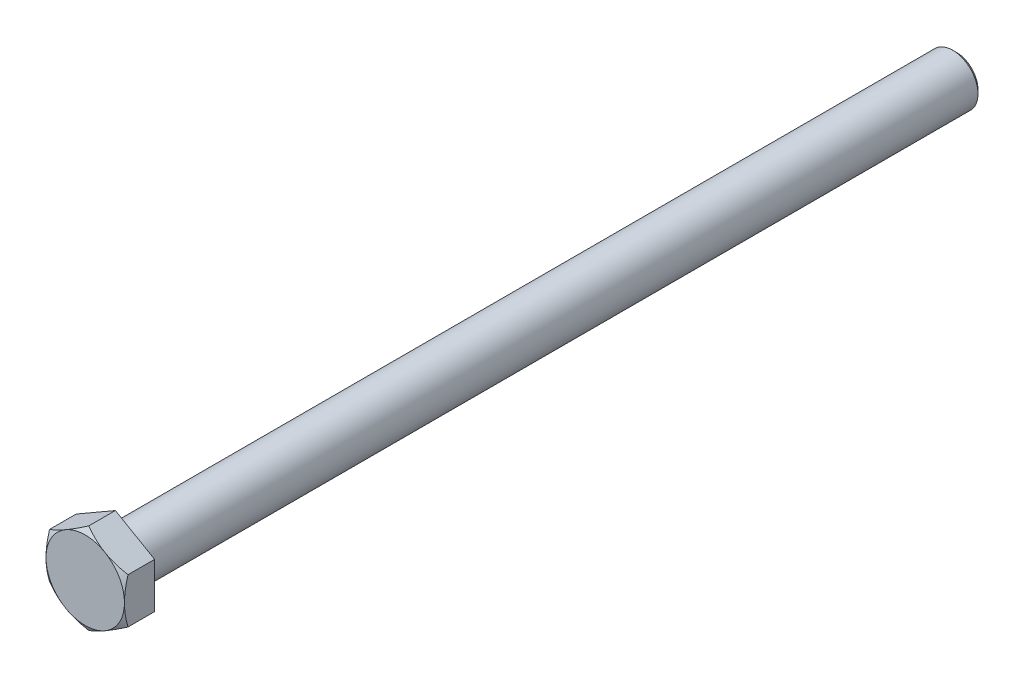
ISO-10303-21;
HEADER;
FILE_DESCRIPTION(('STEP AP214'),'2;1');
FILE_NAME('part.step','',(''),(''),'','','');
FILE_SCHEMA(('AUTOMOTIVE_DESIGN { 1 0 10303 214 1 1 1 1 }'));
ENDSEC;
DATA;
#1=APPLICATION_CONTEXT('core data for automotive mechanical design processes');
#2=APPLICATION_PROTOCOL_DEFINITION('international standard','automotive_design',2000,#1);
#3=PRODUCT_CONTEXT('',#1,'mechanical');
#4=PRODUCT('Part','Part','',(#3));
#5=PRODUCT_RELATED_PRODUCT_CATEGORY('part','',(#4));
#6=PRODUCT_DEFINITION_FORMATION('','',#4);
#7=PRODUCT_DEFINITION_CONTEXT('part definition',#1,'design');
#8=PRODUCT_DEFINITION('design','',#6,#7);
#9=PRODUCT_DEFINITION_SHAPE('','',#8);
#10=(LENGTH_UNIT() NAMED_UNIT(*) SI_UNIT(.MILLI.,.METRE.));
#11=(NAMED_UNIT(*) PLANE_ANGLE_UNIT() SI_UNIT($,.RADIAN.));
#12=(NAMED_UNIT(*) SI_UNIT($,.STERADIAN.) SOLID_ANGLE_UNIT());
#13=UNCERTAINTY_MEASURE_WITH_UNIT(LENGTH_MEASURE(1.E-05),#10,'distance_accuracy_value','');
#14=(GEOMETRIC_REPRESENTATION_CONTEXT(3) GLOBAL_UNCERTAINTY_ASSIGNED_CONTEXT((#13)) GLOBAL_UNIT_ASSIGNED_CONTEXT((#10,
#11,#12)) REPRESENTATION_CONTEXT('',''));
#15=CARTESIAN_POINT('',(0.,0.,0.));
#16=DIRECTION('',(0.,0.,1.));
#17=DIRECTION('',(1.,0.,0.));
#18=AXIS2_PLACEMENT_3D('',#15,#16,#17);
#19=CARTESIAN_POINT('',(0.,0.,0.));
#20=DIRECTION('',(0.,0.,1.));
#21=DIRECTION('',(1.,0.,0.));
#22=AXIS2_PLACEMENT_3D('',#19,#20,#21);
#23=PLANE('',#22);
#24=CARTESIAN_POINT('',(0.,0.,0.));
#25=DIRECTION('',(0.,0.,1.));
#26=DIRECTION('',(1.,0.,0.));
#27=AXIS2_PLACEMENT_3D('',#24,#25,#26);
#28=CIRCLE('',#27,6.6);
#29=CARTESIAN_POINT('',(6.6,0.,0.));
#30=VERTEX_POINT('',#29);
#31=EDGE_CURVE('E146',#30,#30,#28,.T.);
#32=ORIENTED_EDGE('',*,*,#31,.T.);
#33=EDGE_LOOP('',(#32));
#34=FACE_BOUND('',#33,.T.);
#35=CARTESIAN_POINT('',(0.,0.,0.));
#36=DIRECTION('',(0.,0.,1.));
#37=DIRECTION('',(1.,0.,0.));
#38=AXIS2_PLACEMENT_3D('',#35,#36,#37);
#39=CIRCLE('',#38,8.7);
#40=CARTESIAN_POINT('',(8.7,0.,0.));
#41=VERTEX_POINT('',#40);
#42=EDGE_CURVE('E292',#41,#41,#39,.T.);
#43=ORIENTED_EDGE('',*,*,#42,.F.);
#44=EDGE_LOOP('',(#43));
#45=FACE_BOUND('',#44,.T.);
#46=ADVANCED_FACE('F37',(#34,#45),#23,.F.);
#47=CARTESIAN_POINT('',(0.,0.,-0.6));
#48=DIRECTION('',(0.,0.,1.));
#49=DIRECTION('',(1.,0.,0.));
#50=AXIS2_PLACEMENT_3D('',#47,#48,#49);
#51=TOROIDAL_SURFACE('',#50,6.6,0.6);
#52=ORIENTED_EDGE('',*,*,#31,.F.);
#53=EDGE_LOOP('',(#52));
#54=FACE_BOUND('',#53,.T.);
#55=CARTESIAN_POINT('',(0.,0.,-0.6));
#56=DIRECTION('',(0.,0.,1.));
#57=DIRECTION('',(1.,0.,0.));
#58=AXIS2_PLACEMENT_3D('',#55,#56,#57);
#59=CIRCLE('',#58,6.00000000000001);
#60=CARTESIAN_POINT('',(6.00000000000001,0.,-0.6));
#61=VERTEX_POINT('',#60);
#62=EDGE_CURVE('E149',#61,#61,#59,.T.);
#63=ORIENTED_EDGE('',*,*,#62,.T.);
#64=EDGE_LOOP('',(#63));
#65=FACE_BOUND('',#64,.T.);
#66=ADVANCED_FACE('F233',(#54,#65),#51,.F.);
#67=CARTESIAN_POINT('',(0.,0.,0.));
#68=DIRECTION('',(0.,0.,1.));
#69=DIRECTION('',(1.,0.,0.));
#70=AXIS2_PLACEMENT_3D('',#67,#68,#69);
#71=CYLINDRICAL_SURFACE('',#70,6.00000000000002);
#72=ORIENTED_EDGE('',*,*,#62,.F.);
#73=EDGE_LOOP('',(#72));
#74=FACE_BOUND('',#73,.T.);
#75=CARTESIAN_POINT('',(0.,0.,-199.1));
#76=DIRECTION('',(0.,0.,1.));
#77=DIRECTION('',(1.,0.,0.));
#78=AXIS2_PLACEMENT_3D('',#75,#76,#77);
#79=CIRCLE('',#78,6.00000000000003);
#80=CARTESIAN_POINT('',(6.00000000000003,0.,-199.1));
#81=VERTEX_POINT('',#80);
#82=EDGE_CURVE('E152',#81,#81,#79,.T.);
#83=ORIENTED_EDGE('',*,*,#82,.T.);
#84=EDGE_LOOP('',(#83));
#85=FACE_BOUND('',#84,.T.);
#86=ADVANCED_FACE('F239',(#74,#85),#71,.T.);
#87=CARTESIAN_POINT('',(0.,0.,-200.));
#88=DIRECTION('',(0.,0.,1.));
#89=DIRECTION('',(1.,0.,0.));
#90=AXIS2_PLACEMENT_3D('',#87,#88,#89);
#91=CONICAL_SURFACE('',#90,5.1,0.785398163397458);
#92=ORIENTED_EDGE('',*,*,#82,.F.);
#93=EDGE_LOOP('',(#92));
#94=FACE_BOUND('',#93,.T.);
#95=CARTESIAN_POINT('',(0.,0.,-200.));
#96=DIRECTION('',(0.,0.,1.));
#97=DIRECTION('',(1.,0.,0.));
#98=AXIS2_PLACEMENT_3D('',#95,#96,#97);
#99=CIRCLE('',#98,5.1);
#100=CARTESIAN_POINT('',(5.1,0.,-200.));
#101=VERTEX_POINT('',#100);
#102=EDGE_CURVE('E125',#101,#101,#99,.T.);
#103=ORIENTED_EDGE('',*,*,#102,.T.);
#104=EDGE_LOOP('',(#103));
#105=FACE_BOUND('',#104,.T.);
#106=ADVANCED_FACE('F306',(#94,#105),#91,.T.);
#107=CARTESIAN_POINT('',(0.,5.1,-200.));
#108=DIRECTION('',(0.,0.,1.));
#109=DIRECTION('',(1.,0.,0.));
#110=AXIS2_PLACEMENT_3D('',#107,#108,#109);
#111=PLANE('',#110);
#112=ORIENTED_EDGE('',*,*,#102,.F.);
#113=EDGE_LOOP('',(#112));
#114=FACE_BOUND('',#113,.T.);
#115=ADVANCED_FACE('F302',(#114),#111,.F.);
#116=CARTESIAN_POINT('',(0.,10.7791295257703,0.149999999999997));
#117=DIRECTION('',(0.,0.,-1.));
#118=DIRECTION('',(-1.,0.,0.));
#119=AXIS2_PLACEMENT_3D('',#116,#117,#118);
#120=PLANE('',#119);
#121=CARTESIAN_POINT('',(0.,0.,0.149999999999996));
#122=DIRECTION('',(0.,0.,1.));
#123=DIRECTION('',(1.,0.,0.));
#124=AXIS2_PLACEMENT_3D('',#121,#122,#123);
#125=CIRCLE('',#124,8.78660254037844);
#126=CARTESIAN_POINT('',(8.78660254037844,0.,0.149999999999996));
#127=VERTEX_POINT('',#126);
#128=EDGE_CURVE('E289',#127,#127,#125,.T.);
#129=ORIENTED_EDGE('',*,*,#128,.T.);
#130=EDGE_LOOP('',(#129));
#131=FACE_BOUND('',#130,.T.);
#132=DIRECTION('',(0.866025403784439,-0.5,0.));
#133=VECTOR('',#132,1.);
#134=CARTESIAN_POINT('',(9.33499999999998,5.38956476288517,0.149999999999996));
#135=LINE('',#134,#133);
#136=CARTESIAN_POINT('',(0.,10.7791295257703,0.149999999999997));
#137=VERTEX_POINT('',#136);
#138=CARTESIAN_POINT('',(9.33499999999998,5.38956476288517,0.149999999999996));
#139=VERTEX_POINT('',#138);
#140=EDGE_CURVE('E60',#137,#139,#135,.T.);
#141=ORIENTED_EDGE('',*,*,#140,.T.);
#142=DIRECTION('',(0.,-1.,0.));
#143=VECTOR('',#142,1.);
#144=CARTESIAN_POINT('',(9.33499999999999,-5.38956476288515,0.149999999999996));
#145=LINE('',#144,#143);
#146=CARTESIAN_POINT('',(9.33499999999999,-5.38956476288519,0.149999999999997));
#147=VERTEX_POINT('',#146);
#148=EDGE_CURVE('E11',#139,#147,#145,.T.);
#149=ORIENTED_EDGE('',*,*,#148,.T.);
#150=DIRECTION('',(-0.866025403784439,-0.5,0.));
#151=VECTOR('',#150,1.);
#152=CARTESIAN_POINT('',(0.,-10.7791295257703,0.149999999999996));
#153=LINE('',#152,#151);
#154=CARTESIAN_POINT('',(0.,-10.7791295257703,0.149999999999997));
#155=VERTEX_POINT('',#154);
#156=EDGE_CURVE('E160',#147,#155,#153,.T.);
#157=ORIENTED_EDGE('',*,*,#156,.T.);
#158=DIRECTION('',(-0.866025403784439,0.5,0.));
#159=VECTOR('',#158,1.);
#160=CARTESIAN_POINT('',(-9.335,-5.38956476288515,0.149999999999996));
#161=LINE('',#160,#159);
#162=CARTESIAN_POINT('',(-9.33500000000002,-5.38956476288514,0.149999999999997));
#163=VERTEX_POINT('',#162);
#164=EDGE_CURVE('E158',#155,#163,#161,.T.);
#165=ORIENTED_EDGE('',*,*,#164,.T.);
#166=DIRECTION('',(0.,1.,0.));
#167=VECTOR('',#166,1.);
#168=CARTESIAN_POINT('',(-9.335,5.38956476288516,0.149999999999996));
#169=LINE('',#168,#167);
#170=CARTESIAN_POINT('',(-9.335,5.38956476288517,0.149999999999997));
#171=VERTEX_POINT('',#170);
#172=EDGE_CURVE('E111',#163,#171,#169,.T.);
#173=ORIENTED_EDGE('',*,*,#172,.T.);
#174=DIRECTION('',(0.866025403784439,0.5,0.));
#175=VECTOR('',#174,1.);
#176=CARTESIAN_POINT('',(0.,10.7791295257703,0.149999999999996));
#177=LINE('',#176,#175);
#178=EDGE_CURVE('E108',#171,#137,#177,.T.);
#179=ORIENTED_EDGE('',*,*,#178,.T.);
#180=EDGE_LOOP('',(#141,#149,#157,#165,#173,#179));
#181=FACE_BOUND('',#180,.T.);
#182=ADVANCED_FACE('F109',(#131,#181),#120,.T.);
#183=CARTESIAN_POINT('',(0.,0.,0.149999999999996));
#184=DIRECTION('',(0.,0.,1.));
#185=DIRECTION('',(1.,0.,0.));
#186=AXIS2_PLACEMENT_3D('',#183,#184,#185);
#187=CONICAL_SURFACE('',#186,8.78660254037844,0.5235987755983);
#188=ORIENTED_EDGE('',*,*,#42,.T.);
#189=EDGE_LOOP('',(#188));
#190=FACE_BOUND('',#189,.T.);
#191=ORIENTED_EDGE('',*,*,#128,.F.);
#192=EDGE_LOOP('',(#191));
#193=FACE_BOUND('',#192,.T.);
#194=ADVANCED_FACE('F184',(#190,#193),#187,.T.);
#195=CARTESIAN_POINT('',(9.33499999999999,-5.38956476288515,7.32));
#196=DIRECTION('',(-1.,0.,0.));
#197=DIRECTION('',(0.,-1.,0.));
#198=AXIS2_PLACEMENT_3D('',#195,#196,#197);
#199=PLANE('',#198);
#200=CARTESIAN_POINT('',(9.335,-14.2939200065664,2.85295320592981));
#201=CARTESIAN_POINT('',(9.335,-14.088997974891,2.9520094781063));
#202=CARTESIAN_POINT('',(9.335,-13.8838282501419,3.05055309058061));
#203=CARTESIAN_POINT('',(9.335,-13.4729410981215,3.24649731903416));
#204=CARTESIAN_POINT('',(9.335,-13.2672236648764,3.34389792248338));
#205=CARTESIAN_POINT('',(9.335,-12.6491110540912,3.63423693699647));
#206=CARTESIAN_POINT('',(9.335,-12.235822190424,3.82528025363824));
#207=CARTESIAN_POINT('',(9.335,-11.4040234451093,4.20217310927294));
#208=CARTESIAN_POINT('',(9.335,-10.9854972201123,4.38798667006708));
#209=CARTESIAN_POINT('',(9.335,-10.1450055951409,4.75163580727913));
#210=CARTESIAN_POINT('',(9.33499999999999,-9.72304037579279,4.92947179955253));
#211=CARTESIAN_POINT('',(9.33499999999999,-8.86976005799766,5.27715066645378));
#212=CARTESIAN_POINT('',(9.33499999999999,-8.43839377157359,5.44686860657388));
#213=CARTESIAN_POINT('',(9.33499999999999,-7.57057438679006,5.77301256488255));
#214=CARTESIAN_POINT('',(9.33499999999999,-7.1341207286125,5.92943710424978));
#215=CARTESIAN_POINT('',(9.33499999999999,-6.25632320665005,6.22479025996925));
#216=CARTESIAN_POINT('',(9.33499999999999,-5.81499199640146,6.36375607260078));
#217=CARTESIAN_POINT('',(9.33499999999999,-4.92607133486536,6.61968098547224));
#218=CARTESIAN_POINT('',(9.33499999999999,-4.47848391093663,6.73664704501724));
#219=CARTESIAN_POINT('',(9.33499999999999,-3.57667031207659,6.94288552890628));
#220=CARTESIAN_POINT('',(9.33499999999999,-3.12244240313707,7.03215057946492));
#221=CARTESIAN_POINT('',(9.33499999999999,-2.43710350689067,7.14080282116499));
#222=CARTESIAN_POINT('',(9.33499999999999,-2.20796291905845,7.17281503726186));
#223=CARTESIAN_POINT('',(9.33499999999999,-1.7486074317416,7.22779448910464));
#224=CARTESIAN_POINT('',(9.33499999999999,-1.51839264089889,7.25076262030697));
#225=CARTESIAN_POINT('',(9.33499999999999,-1.05866032543275,7.2870357991655));
#226=CARTESIAN_POINT('',(9.33499999999999,-0.829147554394165,7.30040085149546));
#227=CARTESIAN_POINT('',(9.33499999999999,-0.369761997153315,7.3173972114006));
#228=CARTESIAN_POINT('',(9.33499999999999,-0.139889215665096,7.3210286453807));
#229=CARTESIAN_POINT('',(9.33499999999999,0.319737952102246,7.31847123986234));
#230=CARTESIAN_POINT('',(9.33499999999999,0.549492353502908,7.31228515639623));
#231=CARTESIAN_POINT('',(9.33499999999999,1.00854016574668,7.29024654738462));
#232=CARTESIAN_POINT('',(9.33499999999999,1.23783355299476,7.27439353910945));
#233=CARTESIAN_POINT('',(9.33499999999999,1.79357012506472,7.22458635458605));
#234=CARTESIAN_POINT('',(9.33499999999999,2.11958632864347,7.18578870330552));
#235=CARTESIAN_POINT('',(9.33499999999999,2.76912050377264,7.09080439036287));
#236=CARTESIAN_POINT('',(9.33499999999999,3.09263776870017,7.03461298239445));
#237=CARTESIAN_POINT('',(9.33499999999999,3.73690716837231,6.90683408562496));
#238=CARTESIAN_POINT('',(9.33499999999998,4.05765638835195,6.83523203973257));
#239=CARTESIAN_POINT('',(9.33499999999998,4.69585477456489,6.67881653034048));
#240=CARTESIAN_POINT('',(9.33499999999998,5.01330424867696,6.59400431141982));
#241=CARTESIAN_POINT('',(9.33499999999998,5.65272185353181,6.41098051072343));
#242=CARTESIAN_POINT('',(9.33499999999998,5.97461000805293,6.31249144069197));
#243=CARTESIAN_POINT('',(9.33499999999998,6.61498395116541,6.10578201115479));
#244=CARTESIAN_POINT('',(9.33499999999998,6.93347191931351,5.99756836370945));
#245=CARTESIAN_POINT('',(9.33499999999998,7.56576751363664,5.77364503844619));
#246=CARTESIAN_POINT('',(9.33499999999998,7.87959139360188,5.65798098174213));
#247=CARTESIAN_POINT('',(9.33499999999998,8.50480431543778,5.41986404687111));
#248=CARTESIAN_POINT('',(9.33499999999998,8.81619231437714,5.29740842489412));
#249=CARTESIAN_POINT('',(9.33499999999998,9.12644907510167,5.17222885598316));
#250=B_SPLINE_CURVE_WITH_KNOTS('',3,(#200,#201,#202,#203,#204,#205,#206,#207,#208,#209,#210,
#211,#212,#213,#214,#215,#216,#217,#218,#219,#220,#221,#222,#223,#224,#225,#226,#227,#228,#229,
#230,#231,#232,#233,#234,#235,#236,#237,#238,#239,#240,#241,#242,#243,#244,#245,#246,#247,#248,
#249),.UNSPECIFIED.,.F.,.F.,(4,2,2,2,2,2,2,2,2,2,2,2,2,2,2,2,2,2,2,2,2,2,2,2,4),(0.,
0.682821242993056,1.36564996430024,2.73152951663905,4.10522544602874,5.4788496838501,
6.86933776425677,8.25998032725736,9.64760794835793,11.0347958724513,12.4223527386737,
13.1163000222239,13.8101785806472,14.4996828280991,15.1891781213109,15.8784798895067,
16.5678160816468,17.5522174713367,18.5368877158521,19.5224922074151,20.5080038976543,
21.5176726092966,22.5266497067172,23.5299476031869,24.5336538298085),.UNSPECIFIED.);
#251=CARTESIAN_POINT('',(9.33499999999999,-5.38956476288519,6.48623142955183));
#252=VERTEX_POINT('',#251);
#253=CARTESIAN_POINT('',(9.33499999999998,0.,7.32));
#254=VERTEX_POINT('',#253);
#255=EDGE_CURVE('E287',#252,#254,#250,.T.);
#256=ORIENTED_EDGE('',*,*,#255,.F.);
#257=DIRECTION('',(0.,0.,-1.));
#258=VECTOR('',#257,1.);
#259=CARTESIAN_POINT('',(9.33499999999999,-5.38956476288515,7.32));
#260=LINE('',#259,#258);
#261=EDGE_CURVE('E142',#252,#147,#260,.T.);
#262=ORIENTED_EDGE('',*,*,#261,.T.);
#263=ORIENTED_EDGE('',*,*,#148,.F.);
#264=DIRECTION('',(0.,0.,-1.));
#265=VECTOR('',#264,1.);
#266=CARTESIAN_POINT('',(9.33499999999998,5.38956476288517,7.32));
#267=LINE('',#266,#265);
#268=CARTESIAN_POINT('',(9.33499999999998,5.3895647628852,6.48623142955183));
#269=VERTEX_POINT('',#268);
#270=EDGE_CURVE('E124',#269,#139,#267,.T.);
#271=ORIENTED_EDGE('',*,*,#270,.F.);
#272=EDGE_CURVE('E189',#254,#269,#250,.T.);
#273=ORIENTED_EDGE('',*,*,#272,.F.);
#274=EDGE_LOOP('',(#256,#262,#263,#271,#273));
#275=FACE_BOUND('',#274,.T.);
#276=ADVANCED_FACE('F244',(#275),#199,.F.);
#277=CARTESIAN_POINT('',(0.,-10.7791295257703,7.32));
#278=DIRECTION('',(-0.5,0.866025403784439,0.));
#279=DIRECTION('',(-0.866025403784439,-0.5,0.));
#280=AXIS2_PLACEMENT_3D('',#277,#278,#279);
#281=PLANE('',#280);
#282=CARTESIAN_POINT('',(-0.000200000000002617,-10.7792449958241,6.48616476181395));
#283=CARTESIAN_POINT('',(0.205003739617305,-10.6607705615174,6.55455498933169));
#284=CARTESIAN_POINT('',(0.410972586003021,-10.5418543926119,6.61984121047872));
#285=CARTESIAN_POINT('',(0.824561997184406,-10.3030684347324,6.74334436956554));
#286=CARTESIAN_POINT('',(1.03218308144086,-10.1831983458475,6.80155898243152));
#287=CARTESIAN_POINT('',(1.6583917472756,-9.82165660405889,6.96446882046384));
#288=CARTESIAN_POINT('',(2.07945137461319,-9.57855771487064,7.05713121773648));
#289=CARTESIAN_POINT('',(2.70954783258366,-9.21477135524596,7.1657865905452));
#290=CARTESIAN_POINT('',(2.91670220163336,-9.09517072451131,7.19673843665131));
#291=CARTESIAN_POINT('',(3.33197005561576,-8.85541571722877,7.24864273857613));
#292=CARTESIAN_POINT('',(3.54008355893063,-8.73526133006794,7.26959500193762));
#293=CARTESIAN_POINT('',(3.9566577161826,-8.49475212824107,7.30096329050888));
#294=CARTESIAN_POINT('',(4.16511766131585,-8.37439772280314,7.31139183642956));
#295=CARTESIAN_POINT('',(4.58223010787618,-8.13357773949918,7.32149109381474));
#296=CARTESIAN_POINT('',(4.79088260315492,-8.01311216518292,7.32116213765121));
#297=CARTESIAN_POINT('',(5.18096381451778,-7.78789867279675,7.31049475071978));
#298=CARTESIAN_POINT('',(5.36242006195866,-7.68313485949062,7.30145760928999));
#299=CARTESIAN_POINT('',(5.72490816972174,-7.47385225289557,7.27542267819581));
#300=CARTESIAN_POINT('',(5.90593999911264,-7.36933347746485,7.25842432540287));
#301=CARTESIAN_POINT('',(6.44833403144242,-7.0561821368924,7.19588933550018));
#302=CARTESIAN_POINT('',(6.80873615765829,-6.84810387230515,7.13882055797968));
#303=CARTESIAN_POINT('',(7.53336341948446,-6.42974012762767,6.99614801219962));
#304=CARTESIAN_POINT('',(7.89749607658247,-6.2195080400314,6.90993947246362));
#305=CARTESIAN_POINT('',(8.62033129112734,-5.80217893433418,6.71428185816053));
#306=CARTESIAN_POINT('',(8.97904310475508,-5.59507657217471,6.60487873714971));
#307=CARTESIAN_POINT('',(9.33519999999999,-5.38944929283132,6.48616476181395));
#308=B_SPLINE_CURVE_WITH_KNOTS('',3,(#282,#283,#284,#285,#286,#287,#288,#289,#290,#291,#292,
#293,#294,#295,#296,#297,#298,#299,#300,#301,#302,#303,#304,#305,#306,#307),.UNSPECIFIED.,.F.,
.F.,(4,2,2,2,2,2,2,2,2,2,2,2,4),(0.,0.739804294915819,1.47985117544356,2.96309532775817,
3.68651340422469,4.40994540341494,5.1325156728715,5.85506361726942,6.48407412043049,
7.11312912276008,8.3721330571532,9.65905881821138,10.9434583334619),.UNSPECIFIED.);
#309=CARTESIAN_POINT('',(0.,-10.7791295257703,6.48623142955183));
#310=VERTEX_POINT('',#309);
#311=CARTESIAN_POINT('',(4.6675,-8.08434714432774,7.32));
#312=VERTEX_POINT('',#311);
#313=EDGE_CURVE('E258',#310,#312,#308,.T.);
#314=ORIENTED_EDGE('',*,*,#313,.F.);
#315=DIRECTION('',(0.,0.,-1.));
#316=VECTOR('',#315,1.);
#317=CARTESIAN_POINT('',(0.,-10.7791295257703,7.32));
#318=LINE('',#317,#316);
#319=EDGE_CURVE('E139',#310,#155,#318,.T.);
#320=ORIENTED_EDGE('',*,*,#319,.T.);
#321=ORIENTED_EDGE('',*,*,#156,.F.);
#322=ORIENTED_EDGE('',*,*,#261,.F.);
#323=EDGE_CURVE('E199',#312,#252,#308,.T.);
#324=ORIENTED_EDGE('',*,*,#323,.F.);
#325=EDGE_LOOP('',(#314,#320,#321,#322,#324));
#326=FACE_BOUND('',#325,.T.);
#327=ADVANCED_FACE('F247',(#326),#281,.F.);
#328=CARTESIAN_POINT('',(-9.335,-5.38956476288515,7.32));
#329=DIRECTION('',(0.5,0.866025403784439,0.));
#330=DIRECTION('',(-0.866025403784439,0.5,0.));
#331=AXIS2_PLACEMENT_3D('',#328,#329,#330);
#332=PLANE('',#331);
#333=CARTESIAN_POINT('',(-9.3352,-5.38944929283131,6.48616476181394));
#334=CARTESIAN_POINT('',(-9.1299962603827,-5.50792372713808,6.55455498933169));
#335=CARTESIAN_POINT('',(-8.92402741399698,-5.62683989604355,6.61984121047872));
#336=CARTESIAN_POINT('',(-8.5104380028156,-5.8656258539231,6.74334436956554));
#337=CARTESIAN_POINT('',(-8.30281691855915,-5.985495942808,6.80155898243152));
#338=CARTESIAN_POINT('',(-7.67660825272441,-6.34703768459657,6.96446882046384));
#339=CARTESIAN_POINT('',(-7.25554862538681,-6.59013657378481,7.05713121773648));
#340=CARTESIAN_POINT('',(-6.62545216741634,-6.95392293340949,7.1657865905452));
#341=CARTESIAN_POINT('',(-6.41829779836664,-7.07352356414414,7.19673843665131));
#342=CARTESIAN_POINT('',(-6.00302994438424,-7.31327857142668,7.24864273857613));
#343=CARTESIAN_POINT('',(-5.79491644106937,-7.43343295858752,7.26959500193762));
#344=CARTESIAN_POINT('',(-5.3783422838174,-7.67394216041439,7.30096329050888));
#345=CARTESIAN_POINT('',(-5.16988233868415,-7.79429656585232,7.31139183642956));
#346=CARTESIAN_POINT('',(-4.75276989212382,-8.03511654915627,7.32149109381474));
#347=CARTESIAN_POINT('',(-4.54411739684508,-8.15558212347254,7.32116213765121));
#348=CARTESIAN_POINT('',(-4.15403618548222,-8.3807956158587,7.31049475071978));
#349=CARTESIAN_POINT('',(-3.97257993804134,-8.48555942916483,7.30145760928999));
#350=CARTESIAN_POINT('',(-3.61009183027826,-8.69484203575989,7.27542267819581));
#351=CARTESIAN_POINT('',(-3.42906000088736,-8.79936081119061,7.25842432540287));
#352=CARTESIAN_POINT('',(-2.88666596855758,-9.11251215176306,7.19588933550018));
#353=CARTESIAN_POINT('',(-2.52626384234171,-9.3205904163503,7.13882055797968));
#354=CARTESIAN_POINT('',(-1.80163658051554,-9.73895416102778,6.99614801219962));
#355=CARTESIAN_POINT('',(-1.43750392341752,-9.94918624862406,6.90993947246362));
#356=CARTESIAN_POINT('',(-0.714668708872654,-10.3665153543213,6.71428185816053));
#357=CARTESIAN_POINT('',(-0.355956895244918,-10.5736177164808,6.60487873714971));
#358=CARTESIAN_POINT('',(0.000199999999996879,-10.7792449958241,6.48616476181395));
#359=B_SPLINE_CURVE_WITH_KNOTS('',3,(#333,#334,#335,#336,#337,#338,#339,#340,#341,#342,#343,
#344,#345,#346,#347,#348,#349,#350,#351,#352,#353,#354,#355,#356,#357,#358),.UNSPECIFIED.,.F.,
.F.,(4,2,2,2,2,2,2,2,2,2,2,2,4),(0.,0.739804294915818,1.47985117544356,2.96309532775817,
3.68651340422469,4.40994540341494,5.1325156728715,5.85506361726942,6.4840741204305,
7.11312912276008,8.37213305715321,9.65905881821138,10.9434583334619),.UNSPECIFIED.);
#360=CARTESIAN_POINT('',(-9.33500000000002,-5.38956476288514,6.48623142955183));
#361=VERTEX_POINT('',#360);
#362=CARTESIAN_POINT('',(-4.6675,-8.08434714432774,7.32));
#363=VERTEX_POINT('',#362);
#364=EDGE_CURVE('E220',#361,#363,#359,.T.);
#365=ORIENTED_EDGE('',*,*,#364,.F.);
#366=DIRECTION('',(0.,0.,-1.));
#367=VECTOR('',#366,1.);
#368=CARTESIAN_POINT('',(-9.335,-5.38956476288515,7.32));
#369=LINE('',#368,#367);
#370=EDGE_CURVE('E134',#361,#163,#369,.T.);
#371=ORIENTED_EDGE('',*,*,#370,.T.);
#372=ORIENTED_EDGE('',*,*,#164,.F.);
#373=ORIENTED_EDGE('',*,*,#319,.F.);
#374=EDGE_CURVE('E207',#363,#310,#359,.T.);
#375=ORIENTED_EDGE('',*,*,#374,.F.);
#376=EDGE_LOOP('',(#365,#371,#372,#373,#375));
#377=FACE_BOUND('',#376,.T.);
#378=ADVANCED_FACE('F224',(#377),#332,.F.);
#379=CARTESIAN_POINT('',(-9.335,5.38956476288516,7.32));
#380=DIRECTION('',(1.,0.,0.));
#381=DIRECTION('',(0.,0.,-1.));
#382=AXIS2_PLACEMENT_3D('',#379,#380,#381);
#383=PLANE('',#382);
#384=CARTESIAN_POINT('',(-9.335,-14.2939200065664,2.85295320592981));
#385=CARTESIAN_POINT('',(-9.335,-14.088997974891,2.9520094781063));
#386=CARTESIAN_POINT('',(-9.335,-13.8838282501419,3.05055309058061));
#387=CARTESIAN_POINT('',(-9.335,-13.4729410981215,3.24649731903416));
#388=CARTESIAN_POINT('',(-9.335,-13.2672236648764,3.34389792248338));
#389=CARTESIAN_POINT('',(-9.335,-12.6491110540912,3.63423693699647));
#390=CARTESIAN_POINT('',(-9.335,-12.235822190424,3.82528025363824));
#391=CARTESIAN_POINT('',(-9.335,-11.4040234451093,4.20217310927294));
#392=CARTESIAN_POINT('',(-9.335,-10.9854972201123,4.38798667006708));
#393=CARTESIAN_POINT('',(-9.335,-10.1450055951409,4.75163580727913));
#394=CARTESIAN_POINT('',(-9.335,-9.72304037579278,4.92947179955254));
#395=CARTESIAN_POINT('',(-9.335,-8.86976005799765,5.27715066645378));
#396=CARTESIAN_POINT('',(-9.335,-8.43839377157358,5.44686860657388));
#397=CARTESIAN_POINT('',(-9.335,-7.57057438679005,5.77301256488255));
#398=CARTESIAN_POINT('',(-9.335,-7.13412072861249,5.92943710424978));
#399=CARTESIAN_POINT('',(-9.335,-6.25632320665004,6.22479025996925));
#400=CARTESIAN_POINT('',(-9.335,-5.81499199640145,6.36375607260078));
#401=CARTESIAN_POINT('',(-9.335,-4.92607133486535,6.61968098547224));
#402=CARTESIAN_POINT('',(-9.335,-4.47848391093662,6.73664704501724));
#403=CARTESIAN_POINT('',(-9.335,-3.57667031207658,6.94288552890627));
#404=CARTESIAN_POINT('',(-9.335,-3.12244240313706,7.03215057946491));
#405=CARTESIAN_POINT('',(-9.335,-2.43710350689066,7.14080282116498));
#406=CARTESIAN_POINT('',(-9.335,-2.20796291905844,7.17281503726185));
#407=CARTESIAN_POINT('',(-9.335,-1.74860743174159,7.22779448910464));
#408=CARTESIAN_POINT('',(-9.335,-1.51839264089889,7.25076262030696));
#409=CARTESIAN_POINT('',(-9.335,-1.05866032543275,7.2870357991655));
#410=CARTESIAN_POINT('',(-9.335,-0.829147554394156,7.30040085149545));
#411=CARTESIAN_POINT('',(-9.335,-0.369761997153306,7.31739721140059));
#412=CARTESIAN_POINT('',(-9.335,-0.139889215665087,7.32102864538069));
#413=CARTESIAN_POINT('',(-9.335,0.319737952102256,7.31847123986234));
#414=CARTESIAN_POINT('',(-9.335,0.549492353502917,7.31228515639622));
#415=CARTESIAN_POINT('',(-9.335,1.00854016574669,7.29024654738461));
#416=CARTESIAN_POINT('',(-9.335,1.23783355299477,7.27439353910944));
#417=CARTESIAN_POINT('',(-9.335,1.79357012506473,7.22458635458604));
#418=CARTESIAN_POINT('',(-9.335,2.11958632864349,7.18578870330551));
#419=CARTESIAN_POINT('',(-9.335,2.76912050377266,7.09080439036286));
#420=CARTESIAN_POINT('',(-9.335,3.09263776870019,7.03461298239444));
#421=CARTESIAN_POINT('',(-9.335,3.73690716837233,6.90683408562495));
#422=CARTESIAN_POINT('',(-9.335,4.05765638835197,6.83523203973256));
#423=CARTESIAN_POINT('',(-9.335,4.69585477456492,6.67881653034047));
#424=CARTESIAN_POINT('',(-9.335,5.01330424867698,6.59400431141981));
#425=CARTESIAN_POINT('',(-9.335,5.65272185353183,6.41098051072341));
#426=CARTESIAN_POINT('',(-9.335,5.97461000805296,6.31249144069196));
#427=CARTESIAN_POINT('',(-9.335,6.61498395116544,6.10578201115477));
#428=CARTESIAN_POINT('',(-9.335,6.93347191931354,5.99756836370943));
#429=CARTESIAN_POINT('',(-9.335,7.56576751363667,5.77364503844616));
#430=CARTESIAN_POINT('',(-9.335,7.87959139360191,5.65798098174211));
#431=CARTESIAN_POINT('',(-9.335,8.50480431543781,5.41986404687109));
#432=CARTESIAN_POINT('',(-9.335,8.81619231437717,5.2974084248941));
#433=CARTESIAN_POINT('',(-9.335,9.12644907510171,5.17222885598313));
#434=B_SPLINE_CURVE_WITH_KNOTS('',3,(#384,#385,#386,#387,#388,#389,#390,#391,#392,#393,#394,
#395,#396,#397,#398,#399,#400,#401,#402,#403,#404,#405,#406,#407,#408,#409,#410,#411,#412,#413,
#414,#415,#416,#417,#418,#419,#420,#421,#422,#423,#424,#425,#426,#427,#428,#429,#430,#431,#432,
#433),.UNSPECIFIED.,.F.,.F.,(4,2,2,2,2,2,2,2,2,2,2,2,2,2,2,2,2,2,2,2,2,2,2,2,4),(0.,
0.682821242993058,1.36564996430024,2.73152951663905,4.10522544602875,5.47884968385011,
6.86933776425678,8.25998032725737,9.64760794835794,11.0347958724513,12.4223527386737,
13.1163000222239,13.8101785806472,14.4996828280991,15.1891781213109,15.8784798895067,
16.5678160816469,17.5522174713368,18.5368877158522,19.5224922074151,20.5080038976543,
21.5176726092967,22.5266497067173,23.529947603187,24.5336538298086),.UNSPECIFIED.);
#435=CARTESIAN_POINT('',(-9.335,5.38956476288517,6.48623142955183));
#436=VERTEX_POINT('',#435);
#437=CARTESIAN_POINT('',(-9.335,0.,7.32));
#438=VERTEX_POINT('',#437);
#439=EDGE_CURVE('E219',#436,#438,#434,.F.);
#440=ORIENTED_EDGE('',*,*,#439,.F.);
#441=DIRECTION('',(0.,0.,-1.));
#442=VECTOR('',#441,1.);
#443=CARTESIAN_POINT('',(-9.335,5.38956476288516,7.32));
#444=LINE('',#443,#442);
#445=EDGE_CURVE('E131',#436,#171,#444,.T.);
#446=ORIENTED_EDGE('',*,*,#445,.T.);
#447=ORIENTED_EDGE('',*,*,#172,.F.);
#448=ORIENTED_EDGE('',*,*,#370,.F.);
#449=EDGE_CURVE('E213',#438,#361,#434,.F.);
#450=ORIENTED_EDGE('',*,*,#449,.F.);
#451=EDGE_LOOP('',(#440,#446,#447,#448,#450));
#452=FACE_BOUND('',#451,.T.);
#453=ADVANCED_FACE('F221',(#452),#383,.F.);
#454=CARTESIAN_POINT('',(0.,10.7791295257703,7.32));
#455=DIRECTION('',(0.5,-0.866025403784439,0.));
#456=DIRECTION('',(0.866025403784439,0.5,0.));
#457=AXIS2_PLACEMENT_3D('',#454,#455,#456);
#458=PLANE('',#457);
#459=CARTESIAN_POINT('',(0.000200000000000431,10.7792449958242,6.48616476181394));
#460=CARTESIAN_POINT('',(-0.205003739617307,10.6607705615174,6.55455498933168));
#461=CARTESIAN_POINT('',(-0.410972586003023,10.5418543926119,6.61984121047871));
#462=CARTESIAN_POINT('',(-0.824561997184408,10.3030684347324,6.74334436956554));
#463=CARTESIAN_POINT('',(-1.03218308144086,10.1831983458475,6.80155898243152));
#464=CARTESIAN_POINT('',(-1.6583917472756,9.8216566040589,6.96446882046383));
#465=CARTESIAN_POINT('',(-2.07945137461319,9.57855771487066,7.05713121773647));
#466=CARTESIAN_POINT('',(-2.70954783258366,9.21477135524598,7.16578659054519));
#467=CARTESIAN_POINT('',(-2.91670220163336,9.09517072451132,7.1967384366513));
#468=CARTESIAN_POINT('',(-3.33197005561576,8.85541571722879,7.24864273857613));
#469=CARTESIAN_POINT('',(-3.54008355893064,8.73526133006795,7.26959500193761));
#470=CARTESIAN_POINT('',(-3.95665771618261,8.49475212824108,7.30096329050887));
#471=CARTESIAN_POINT('',(-4.16511766131585,8.37439772280315,7.31139183642955));
#472=CARTESIAN_POINT('',(-4.58223010787619,8.13357773949919,7.32149109381474));
#473=CARTESIAN_POINT('',(-4.79088260315493,8.01311216518293,7.3211621376512));
#474=CARTESIAN_POINT('',(-5.18096381451779,7.78789867279676,7.31049475071977));
#475=CARTESIAN_POINT('',(-5.36242006195867,7.68313485949063,7.30145760928998));
#476=CARTESIAN_POINT('',(-5.72490816972175,7.47385225289558,7.2754226781958));
#477=CARTESIAN_POINT('',(-5.90593999911265,7.36933347746486,7.25842432540286));
#478=CARTESIAN_POINT('',(-6.44833403144242,7.05618213689241,7.19588933550017));
#479=CARTESIAN_POINT('',(-6.8087361576583,6.84810387230516,7.13882055797967));
#480=CARTESIAN_POINT('',(-7.53336341948447,6.42974012762769,6.99614801219961));
#481=CARTESIAN_POINT('',(-7.89749607658248,6.21950804003141,6.90993947246361));
#482=CARTESIAN_POINT('',(-8.62033129112735,5.80217893433419,6.71428185816052));
#483=CARTESIAN_POINT('',(-8.97904310475509,5.59507657217472,6.6048787371497));
#484=CARTESIAN_POINT('',(-9.3352,5.38944929283133,6.48616476181394));
#485=B_SPLINE_CURVE_WITH_KNOTS('',3,(#459,#460,#461,#462,#463,#464,#465,#466,#467,#468,#469,
#470,#471,#472,#473,#474,#475,#476,#477,#478,#479,#480,#481,#482,#483,#484),.UNSPECIFIED.,.F.,
.F.,(4,2,2,2,2,2,2,2,2,2,2,2,4),(0.,0.739804294915817,1.47985117544356,2.96309532775817,
3.6865134042247,4.40994540341494,5.13251567287151,5.85506361726942,6.4840741204305,
7.11312912276009,8.37213305715321,9.65905881821138,10.9434583334619),.UNSPECIFIED.);
#486=CARTESIAN_POINT('',(0.,10.7791295257703,6.48623142955183));
#487=VERTEX_POINT('',#486);
#488=CARTESIAN_POINT('',(-4.6675,8.08434714432774,7.32));
#489=VERTEX_POINT('',#488);
#490=EDGE_CURVE('E130',#487,#489,#485,.T.);
#491=ORIENTED_EDGE('',*,*,#490,.F.);
#492=DIRECTION('',(0.,0.,-1.));
#493=VECTOR('',#492,1.);
#494=CARTESIAN_POINT('',(0.,10.7791295257703,7.32));
#495=LINE('',#494,#493);
#496=EDGE_CURVE('E122',#487,#137,#495,.T.);
#497=ORIENTED_EDGE('',*,*,#496,.T.);
#498=ORIENTED_EDGE('',*,*,#178,.F.);
#499=ORIENTED_EDGE('',*,*,#445,.F.);
#500=EDGE_CURVE('E170',#489,#436,#485,.T.);
#501=ORIENTED_EDGE('',*,*,#500,.F.);
#502=EDGE_LOOP('',(#491,#497,#498,#499,#501));
#503=FACE_BOUND('',#502,.T.);
#504=ADVANCED_FACE('F128',(#503),#458,.F.);
#505=CARTESIAN_POINT('',(9.33499999999998,5.38956476288517,7.32));
#506=DIRECTION('',(-0.5,-0.866025403784439,0.));
#507=DIRECTION('',(0.866025403784439,-0.5,0.));
#508=AXIS2_PLACEMENT_3D('',#505,#506,#507);
#509=PLANE('',#508);
#510=CARTESIAN_POINT('',(9.33519999999999,5.38944929283133,6.48616476181394));
#511=CARTESIAN_POINT('',(9.12999626038268,5.5079237271381,6.55455498933169));
#512=CARTESIAN_POINT('',(8.92402741399696,5.62683989604357,6.61984121047872));
#513=CARTESIAN_POINT('',(8.51043800281558,5.86562585392312,6.74334436956554));
#514=CARTESIAN_POINT('',(8.30281691855913,5.98549594280803,6.80155898243152));
#515=CARTESIAN_POINT('',(7.67660825272439,6.34703768459659,6.96446882046384));
#516=CARTESIAN_POINT('',(7.25554862538679,6.59013657378484,7.05713121773648));
#517=CARTESIAN_POINT('',(6.62545216741633,6.95392293340952,7.1657865905452));
#518=CARTESIAN_POINT('',(6.41829779836663,7.07352356414417,7.19673843665131));
#519=CARTESIAN_POINT('',(6.00302994438423,7.3132785714267,7.24864273857613));
#520=CARTESIAN_POINT('',(5.79491644106935,7.43343295858754,7.26959500193761));
#521=CARTESIAN_POINT('',(5.37834228381738,7.67394216041441,7.30096329050887));
#522=CARTESIAN_POINT('',(5.16988233868414,7.79429656585234,7.31139183642955));
#523=CARTESIAN_POINT('',(4.7527698921238,8.0351165491563,7.32149109381474));
#524=CARTESIAN_POINT('',(4.54411739684506,8.15558212347256,7.3211621376512));
#525=CARTESIAN_POINT('',(4.1540361854822,8.38079561585873,7.31049475071977));
#526=CARTESIAN_POINT('',(3.97257993804132,8.48555942916486,7.30145760928998));
#527=CARTESIAN_POINT('',(3.61009183027824,8.69484203575991,7.2754226781958));
#528=CARTESIAN_POINT('',(3.42906000088734,8.79936081119063,7.25842432540286));
#529=CARTESIAN_POINT('',(2.88666596855757,9.11251215176308,7.19588933550017));
#530=CARTESIAN_POINT('',(2.52626384234169,9.32059041635033,7.13882055797967));
#531=CARTESIAN_POINT('',(1.80163658051553,9.7389541610278,6.99614801219961));
#532=CARTESIAN_POINT('',(1.43750392341752,9.94918624862408,6.90993947246361));
#533=CARTESIAN_POINT('',(0.71466870887265,10.3665153543213,6.71428185816052));
#534=CARTESIAN_POINT('',(0.355956895244915,10.5736177164808,6.6048787371497));
#535=CARTESIAN_POINT('',(-0.000199999999998624,10.7792449958242,6.48616476181394));
#536=B_SPLINE_CURVE_WITH_KNOTS('',3,(#510,#511,#512,#513,#514,#515,#516,#517,#518,#519,#520,
#521,#522,#523,#524,#525,#526,#527,#528,#529,#530,#531,#532,#533,#534,#535),.UNSPECIFIED.,.F.,
.F.,(4,2,2,2,2,2,2,2,2,2,2,2,4),(0.,0.739804294915818,1.47985117544356,2.96309532775817,
3.68651340422469,4.40994540341494,5.1325156728715,5.85506361726942,6.48407412043049,
7.11312912276008,8.3721330571532,9.65905881821137,10.9434583334619),.UNSPECIFIED.);
#537=CARTESIAN_POINT('',(4.6675,8.08434714432774,7.32));
#538=VERTEX_POINT('',#537);
#539=EDGE_CURVE('E162',#269,#538,#536,.T.);
#540=ORIENTED_EDGE('',*,*,#539,.F.);
#541=ORIENTED_EDGE('',*,*,#270,.T.);
#542=ORIENTED_EDGE('',*,*,#140,.F.);
#543=ORIENTED_EDGE('',*,*,#496,.F.);
#544=EDGE_CURVE('E163',#538,#487,#536,.T.);
#545=ORIENTED_EDGE('',*,*,#544,.F.);
#546=EDGE_LOOP('',(#540,#541,#542,#543,#545));
#547=FACE_BOUND('',#546,.T.);
#548=ADVANCED_FACE('F39',(#547),#509,.F.);
#549=CARTESIAN_POINT('',(0.,0.,7.32));
#550=DIRECTION('',(0.,0.,-1.));
#551=DIRECTION('',(-1.,0.,0.));
#552=AXIS2_PLACEMENT_3D('',#549,#550,#551);
#553=CONICAL_SURFACE('',#552,9.335,1.0471975511966);
#554=ORIENTED_EDGE('',*,*,#323,.T.);
#555=ORIENTED_EDGE('',*,*,#255,.T.);
#556=CARTESIAN_POINT('',(0.,0.,7.32));
#557=DIRECTION('',(0.,0.,1.));
#558=DIRECTION('',(1.,0.,0.));
#559=AXIS2_PLACEMENT_3D('',#556,#557,#558);
#560=CIRCLE('',#559,9.335);
#561=EDGE_CURVE('E53',#312,#254,#560,.T.);
#562=ORIENTED_EDGE('',*,*,#561,.F.);
#563=EDGE_LOOP('',(#554,#555,#562));
#564=FACE_BOUND('',#563,.T.);
#565=ADVANCED_FACE('F183',(#564),#553,.T.);
#566=ORIENTED_EDGE('',*,*,#374,.T.);
#567=ORIENTED_EDGE('',*,*,#313,.T.);
#568=EDGE_CURVE('E133',#363,#312,#560,.T.);
#569=ORIENTED_EDGE('',*,*,#568,.F.);
#570=EDGE_LOOP('',(#566,#567,#569));
#571=FACE_BOUND('',#570,.T.);
#572=ADVANCED_FACE('F390',(#571),#553,.T.);
#573=ORIENTED_EDGE('',*,*,#449,.T.);
#574=ORIENTED_EDGE('',*,*,#364,.T.);
#575=EDGE_CURVE('E279',#438,#363,#560,.T.);
#576=ORIENTED_EDGE('',*,*,#575,.F.);
#577=EDGE_LOOP('',(#573,#574,#576));
#578=FACE_BOUND('',#577,.T.);
#579=ADVANCED_FACE('F280',(#578),#553,.T.);
#580=ORIENTED_EDGE('',*,*,#500,.T.);
#581=ORIENTED_EDGE('',*,*,#439,.T.);
#582=EDGE_CURVE('E275',#489,#438,#560,.T.);
#583=ORIENTED_EDGE('',*,*,#582,.F.);
#584=EDGE_LOOP('',(#580,#581,#583));
#585=FACE_BOUND('',#584,.T.);
#586=ADVANCED_FACE('F273',(#585),#553,.T.);
#587=ORIENTED_EDGE('',*,*,#544,.T.);
#588=ORIENTED_EDGE('',*,*,#490,.T.);
#589=EDGE_CURVE('E46',#538,#489,#560,.T.);
#590=ORIENTED_EDGE('',*,*,#589,.F.);
#591=EDGE_LOOP('',(#587,#588,#590));
#592=FACE_BOUND('',#591,.T.);
#593=ADVANCED_FACE('F181',(#592),#553,.T.);
#594=ORIENTED_EDGE('',*,*,#539,.T.);
#595=CARTESIAN_POINT('',(0.,0.,7.32));
#596=DIRECTION('',(0.,0.,1.));
#597=DIRECTION('',(1.,0.,0.));
#598=AXIS2_PLACEMENT_3D('',#595,#596,#597);
#599=CIRCLE('',#598,9.335);
#600=EDGE_CURVE('E283',#254,#538,#599,.T.);
#601=ORIENTED_EDGE('',*,*,#600,.F.);
#602=ORIENTED_EDGE('',*,*,#272,.T.);
#603=EDGE_LOOP('',(#594,#601,#602));
#604=FACE_BOUND('',#603,.T.);
#605=ADVANCED_FACE('F176',(#604),#553,.T.);
#606=CARTESIAN_POINT('',(0.,0.,7.32));
#607=DIRECTION('',(0.,0.,1.));
#608=DIRECTION('',(1.,0.,0.));
#609=AXIS2_PLACEMENT_3D('',#606,#607,#608);
#610=PLANE('',#609);
#611=ORIENTED_EDGE('',*,*,#561,.T.);
#612=ORIENTED_EDGE('',*,*,#600,.T.);
#613=ORIENTED_EDGE('',*,*,#589,.T.);
#614=ORIENTED_EDGE('',*,*,#582,.T.);
#615=ORIENTED_EDGE('',*,*,#575,.T.);
#616=ORIENTED_EDGE('',*,*,#568,.T.);
#617=EDGE_LOOP('',(#611,#612,#613,#614,#615,#616));
#618=FACE_BOUND('',#617,.T.);
#619=ADVANCED_FACE('F180',(#618),#610,.T.);
#620=CLOSED_SHELL('',(#46,#66,#86,#106,#115,#182,#194,#276,#327,#378,#453,#504,#548,#565,#572,
#579,#586,#593,#605,#619));
#621=MANIFOLD_SOLID_BREP('B2',#620);
#622=ADVANCED_BREP_SHAPE_REPRESENTATION('',(#18,#621),#14);
#623=SHAPE_DEFINITION_REPRESENTATION(#9,#622);
ENDSEC;
END-ISO-10303-21;
